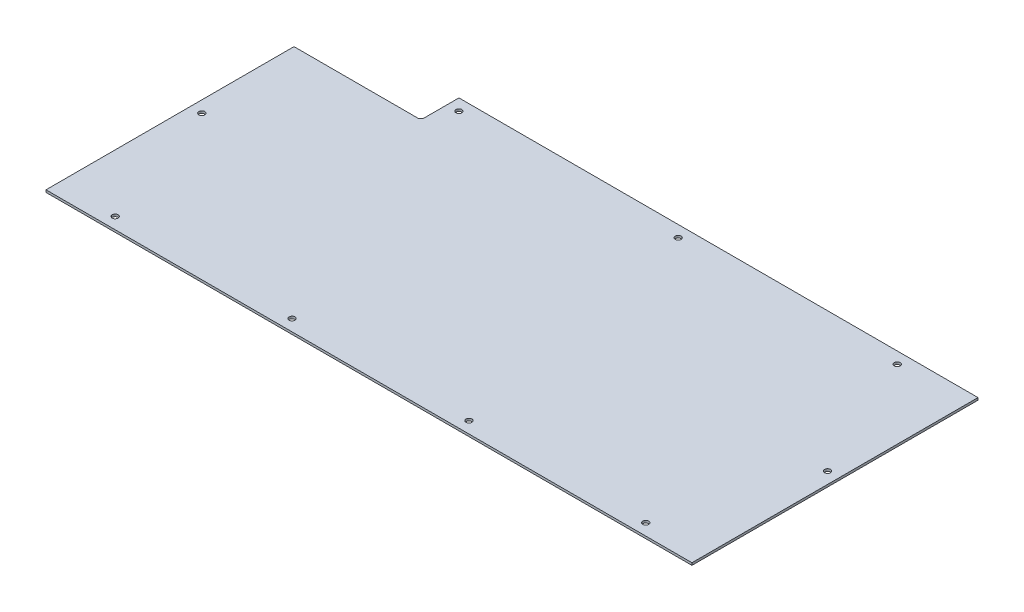
ISO-10303-21;
HEADER;
FILE_DESCRIPTION(('STEP AP214'),'2;1');
FILE_NAME('part.step','',(''),(''),'','','');
FILE_SCHEMA(('AUTOMOTIVE_DESIGN { 1 0 10303 214 1 1 1 1 }'));
ENDSEC;
DATA;
#1=APPLICATION_CONTEXT('core data for automotive mechanical design processes');
#2=APPLICATION_PROTOCOL_DEFINITION('international standard','automotive_design',2000,#1);
#3=PRODUCT_CONTEXT('',#1,'mechanical');
#4=PRODUCT('Part','Part','',(#3));
#5=PRODUCT_RELATED_PRODUCT_CATEGORY('part','',(#4));
#6=PRODUCT_DEFINITION_FORMATION('','',#4);
#7=PRODUCT_DEFINITION_CONTEXT('part definition',#1,'design');
#8=PRODUCT_DEFINITION('design','',#6,#7);
#9=PRODUCT_DEFINITION_SHAPE('','',#8);
#10=(LENGTH_UNIT() NAMED_UNIT(*) SI_UNIT(.MILLI.,.METRE.));
#11=(NAMED_UNIT(*) PLANE_ANGLE_UNIT() SI_UNIT($,.RADIAN.));
#12=(NAMED_UNIT(*) SI_UNIT($,.STERADIAN.) SOLID_ANGLE_UNIT());
#13=UNCERTAINTY_MEASURE_WITH_UNIT(LENGTH_MEASURE(1.E-05),#10,'distance_accuracy_value','');
#14=(GEOMETRIC_REPRESENTATION_CONTEXT(3) GLOBAL_UNCERTAINTY_ASSIGNED_CONTEXT((#13)) GLOBAL_UNIT_ASSIGNED_CONTEXT((#10,
#11,#12)) REPRESENTATION_CONTEXT('',''));
#15=CARTESIAN_POINT('',(0.,0.,0.));
#16=DIRECTION('',(0.,0.,1.));
#17=DIRECTION('',(1.,0.,0.));
#18=AXIS2_PLACEMENT_3D('',#15,#16,#17);
#19=CARTESIAN_POINT('',(-181.14438228891,2.,-90.393202129197));
#20=DIRECTION('',(0.,-1.,0.));
#21=DIRECTION('',(0.,0.,-1.));
#22=AXIS2_PLACEMENT_3D('',#19,#20,#21);
#23=PLANE('',#22);
#24=DIRECTION('',(0.,0.,-1.));
#25=VECTOR('',#24,1.);
#26=CARTESIAN_POINT('',(271.85561771109,2.,127.606797870803));
#27=LINE('',#26,#25);
#28=CARTESIAN_POINT('',(271.85561771109,2.,127.606797870803));
#29=VERTEX_POINT('',#28);
#30=CARTESIAN_POINT('',(271.85561771109,2.,-120.393202129197));
#31=VERTEX_POINT('',#30);
#32=EDGE_CURVE('E137',#29,#31,#27,.T.);
#33=ORIENTED_EDGE('',*,*,#32,.T.);
#34=DIRECTION('',(-1.,0.,0.));
#35=VECTOR('',#34,1.);
#36=CARTESIAN_POINT('',(-178.14438228891,2.,-120.393202129197));
#37=LINE('',#36,#35);
#38=CARTESIAN_POINT('',(-178.14438228891,2.,-120.393202129197));
#39=VERTEX_POINT('',#38);
#40=EDGE_CURVE('E90',#31,#39,#37,.T.);
#41=ORIENTED_EDGE('',*,*,#40,.T.);
#42=DIRECTION('',(0.,0.,1.));
#43=VECTOR('',#42,1.);
#44=CARTESIAN_POINT('',(-178.14438228891,2.,-90.393202129197));
#45=LINE('',#44,#43);
#46=CARTESIAN_POINT('',(-178.14438228891,2.,-90.393202129197));
#47=VERTEX_POINT('',#46);
#48=EDGE_CURVE('E149',#39,#47,#45,.T.);
#49=ORIENTED_EDGE('',*,*,#48,.T.);
#50=CARTESIAN_POINT('',(-181.14438228891,2.,-90.393202129197));
#51=DIRECTION('',(0.,-1.,0.));
#52=DIRECTION('',(0.,0.,-1.));
#53=AXIS2_PLACEMENT_3D('',#50,#51,#52);
#54=CIRCLE('',#53,3.00000000000001);
#55=CARTESIAN_POINT('',(-181.144388941207,2.,-87.3932021292044));
#56=VERTEX_POINT('',#55);
#57=EDGE_CURVE('E106',#47,#56,#54,.T.);
#58=ORIENTED_EDGE('',*,*,#57,.T.);
#59=DIRECTION('',(-0.999999999997541,0.,-2.21743215454546E-06));
#60=VECTOR('',#59,1.);
#61=CARTESIAN_POINT('',(-288.14438228891,2.,-87.3934393944302));
#62=LINE('',#61,#60);
#63=CARTESIAN_POINT('',(-288.14438228891,2.,-87.3934393944302));
#64=VERTEX_POINT('',#63);
#65=EDGE_CURVE('E100',#56,#64,#62,.T.);
#66=ORIENTED_EDGE('',*,*,#65,.T.);
#67=DIRECTION('',(0.,0.,1.));
#68=VECTOR('',#67,1.);
#69=CARTESIAN_POINT('',(-288.14438228891,2.,127.606797870803));
#70=LINE('',#69,#68);
#71=CARTESIAN_POINT('',(-288.14438228891,2.,127.606797870803));
#72=VERTEX_POINT('',#71);
#73=EDGE_CURVE('E104',#64,#72,#70,.T.);
#74=ORIENTED_EDGE('',*,*,#73,.T.);
#75=DIRECTION('',(1.,0.,0.));
#76=VECTOR('',#75,1.);
#77=CARTESIAN_POINT('',(-288.14438228891,2.,127.606797870803));
#78=LINE('',#77,#76);
#79=EDGE_CURVE('E50',#72,#29,#78,.T.);
#80=ORIENTED_EDGE('',*,*,#79,.T.);
#81=EDGE_LOOP('',(#33,#41,#49,#58,#66,#74,#80));
#82=FACE_BOUND('',#81,.T.);
#83=CARTESIAN_POINT('',(211.85561771109,2.,-110.393202129197));
#84=DIRECTION('',(0.,1.,0.));
#85=DIRECTION('',(0.,0.,1.));
#86=AXIS2_PLACEMENT_3D('',#83,#84,#85);
#87=CIRCLE('',#86,2.54999999999999);
#88=CARTESIAN_POINT('',(211.85561771109,2.,-107.843202129197));
#89=VERTEX_POINT('',#88);
#90=EDGE_CURVE('E128',#89,#89,#87,.T.);
#91=ORIENTED_EDGE('',*,*,#90,.F.);
#92=EDGE_LOOP('',(#91));
#93=FACE_BOUND('',#92,.T.);
#94=CARTESIAN_POINT('',(-168.14438228891,2.,-110.393202129197));
#95=DIRECTION('',(0.,1.,0.));
#96=DIRECTION('',(0.,0.,1.));
#97=AXIS2_PLACEMENT_3D('',#94,#95,#96);
#98=CIRCLE('',#97,2.54999999999999);
#99=CARTESIAN_POINT('',(-168.14438228891,2.,-107.843202129197));
#100=VERTEX_POINT('',#99);
#101=EDGE_CURVE('E164',#100,#100,#98,.T.);
#102=ORIENTED_EDGE('',*,*,#101,.F.);
#103=EDGE_LOOP('',(#102));
#104=FACE_BOUND('',#103,.T.);
#105=CARTESIAN_POINT('',(21.85561771109,2.,-110.393202129197));
#106=DIRECTION('',(0.,1.,0.));
#107=DIRECTION('',(0.,0.,1.));
#108=AXIS2_PLACEMENT_3D('',#105,#106,#107);
#109=CIRCLE('',#108,2.54999999999999);
#110=CARTESIAN_POINT('',(21.85561771109,2.,-107.843202129197));
#111=VERTEX_POINT('',#110);
#112=EDGE_CURVE('E170',#111,#111,#109,.T.);
#113=ORIENTED_EDGE('',*,*,#112,.F.);
#114=EDGE_LOOP('',(#113));
#115=FACE_BOUND('',#114,.T.);
#116=CARTESIAN_POINT('',(-238.14438228891,2.,117.606797870803));
#117=DIRECTION('',(0.,1.,0.));
#118=DIRECTION('',(0.,0.,1.));
#119=AXIS2_PLACEMENT_3D('',#116,#117,#118);
#120=CIRCLE('',#119,2.54999999999999);
#121=CARTESIAN_POINT('',(-238.14438228891,2.,120.156797870803));
#122=VERTEX_POINT('',#121);
#123=EDGE_CURVE('E176',#122,#122,#120,.T.);
#124=ORIENTED_EDGE('',*,*,#123,.F.);
#125=EDGE_LOOP('',(#124));
#126=FACE_BOUND('',#125,.T.);
#127=CARTESIAN_POINT('',(261.85561771109,2.,0.));
#128=DIRECTION('',(0.,1.,0.));
#129=DIRECTION('',(0.,0.,1.));
#130=AXIS2_PLACEMENT_3D('',#127,#128,#129);
#131=CIRCLE('',#130,2.54999999999999);
#132=CARTESIAN_POINT('',(261.85561771109,2.,2.54999999999999));
#133=VERTEX_POINT('',#132);
#134=EDGE_CURVE('E182',#133,#133,#131,.T.);
#135=ORIENTED_EDGE('',*,*,#134,.F.);
#136=EDGE_LOOP('',(#135));
#137=FACE_BOUND('',#136,.T.);
#138=CARTESIAN_POINT('',(-84.8110489555766,2.,117.606797870803));
#139=DIRECTION('',(0.,1.,0.));
#140=DIRECTION('',(0.,0.,1.));
#141=AXIS2_PLACEMENT_3D('',#138,#139,#140);
#142=CIRCLE('',#141,2.54999999999999);
#143=CARTESIAN_POINT('',(-84.8110489555766,2.,120.156797870803));
#144=VERTEX_POINT('',#143);
#145=EDGE_CURVE('E188',#144,#144,#142,.T.);
#146=ORIENTED_EDGE('',*,*,#145,.F.);
#147=EDGE_LOOP('',(#146));
#148=FACE_BOUND('',#147,.T.);
#149=CARTESIAN_POINT('',(68.5222843777568,2.,117.606797870803));
#150=DIRECTION('',(0.,1.,0.));
#151=DIRECTION('',(0.,0.,1.));
#152=AXIS2_PLACEMENT_3D('',#149,#150,#151);
#153=CIRCLE('',#152,2.54999999999999);
#154=CARTESIAN_POINT('',(68.5222843777568,2.,120.156797870803));
#155=VERTEX_POINT('',#154);
#156=EDGE_CURVE('E194',#155,#155,#153,.T.);
#157=ORIENTED_EDGE('',*,*,#156,.F.);
#158=EDGE_LOOP('',(#157));
#159=FACE_BOUND('',#158,.T.);
#160=CARTESIAN_POINT('',(221.85561771109,2.,117.606797870803));
#161=DIRECTION('',(0.,1.,0.));
#162=DIRECTION('',(0.,0.,1.));
#163=AXIS2_PLACEMENT_3D('',#160,#161,#162);
#164=CIRCLE('',#163,2.54999999999999);
#165=CARTESIAN_POINT('',(221.85561771109,2.,120.156797870803));
#166=VERTEX_POINT('',#165);
#167=EDGE_CURVE('E200',#166,#166,#164,.T.);
#168=ORIENTED_EDGE('',*,*,#167,.F.);
#169=EDGE_LOOP('',(#168));
#170=FACE_BOUND('',#169,.T.);
#171=CARTESIAN_POINT('',(-278.14438228891,2.,2.54999999999999));
#172=DIRECTION('',(0.,1.,0.));
#173=DIRECTION('',(0.,0.,1.));
#174=AXIS2_PLACEMENT_3D('',#171,#172,#173);
#175=CIRCLE('',#174,2.54999999999999);
#176=CARTESIAN_POINT('',(-278.14438228891,2.,5.09999999999998));
#177=VERTEX_POINT('',#176);
#178=EDGE_CURVE('E206',#177,#177,#175,.T.);
#179=ORIENTED_EDGE('',*,*,#178,.F.);
#180=EDGE_LOOP('',(#179));
#181=FACE_BOUND('',#180,.T.);
#182=ADVANCED_FACE('F33',(#82,#93,#104,#115,#126,#137,#148,#159,#170,#181),#23,.F.);
#183=CARTESIAN_POINT('',(-181.14438228891,0.,-90.393202129197));
#184=DIRECTION('',(0.,-1.,0.));
#185=DIRECTION('',(0.,0.,-1.));
#186=AXIS2_PLACEMENT_3D('',#183,#184,#185);
#187=PLANE('',#186);
#188=CARTESIAN_POINT('',(221.85561771109,0.,117.606797870803));
#189=DIRECTION('',(0.,1.,0.));
#190=DIRECTION('',(0.,0.,1.));
#191=AXIS2_PLACEMENT_3D('',#188,#189,#190);
#192=CIRCLE('',#191,2.54999999999999);
#193=CARTESIAN_POINT('',(221.85561771109,0.,120.156797870803));
#194=VERTEX_POINT('',#193);
#195=EDGE_CURVE('E203',#194,#194,#192,.T.);
#196=ORIENTED_EDGE('',*,*,#195,.T.);
#197=EDGE_LOOP('',(#196));
#198=FACE_BOUND('',#197,.T.);
#199=CARTESIAN_POINT('',(-84.8110489555766,0.,117.606797870803));
#200=DIRECTION('',(0.,1.,0.));
#201=DIRECTION('',(0.,0.,1.));
#202=AXIS2_PLACEMENT_3D('',#199,#200,#201);
#203=CIRCLE('',#202,2.54999999999999);
#204=CARTESIAN_POINT('',(-84.8110489555766,0.,120.156797870803));
#205=VERTEX_POINT('',#204);
#206=EDGE_CURVE('E191',#205,#205,#203,.T.);
#207=ORIENTED_EDGE('',*,*,#206,.T.);
#208=EDGE_LOOP('',(#207));
#209=FACE_BOUND('',#208,.T.);
#210=CARTESIAN_POINT('',(-238.14438228891,0.,117.606797870803));
#211=DIRECTION('',(0.,1.,0.));
#212=DIRECTION('',(0.,0.,1.));
#213=AXIS2_PLACEMENT_3D('',#210,#211,#212);
#214=CIRCLE('',#213,2.54999999999999);
#215=CARTESIAN_POINT('',(-238.14438228891,0.,120.156797870803));
#216=VERTEX_POINT('',#215);
#217=EDGE_CURVE('E179',#216,#216,#214,.T.);
#218=ORIENTED_EDGE('',*,*,#217,.T.);
#219=EDGE_LOOP('',(#218));
#220=FACE_BOUND('',#219,.T.);
#221=CARTESIAN_POINT('',(-168.14438228891,0.,-110.393202129197));
#222=DIRECTION('',(0.,1.,0.));
#223=DIRECTION('',(0.,0.,1.));
#224=AXIS2_PLACEMENT_3D('',#221,#222,#223);
#225=CIRCLE('',#224,2.54999999999999);
#226=CARTESIAN_POINT('',(-168.14438228891,0.,-107.843202129197));
#227=VERTEX_POINT('',#226);
#228=EDGE_CURVE('E167',#227,#227,#225,.T.);
#229=ORIENTED_EDGE('',*,*,#228,.T.);
#230=EDGE_LOOP('',(#229));
#231=FACE_BOUND('',#230,.T.);
#232=DIRECTION('',(0.,0.,-1.));
#233=VECTOR('',#232,1.);
#234=CARTESIAN_POINT('',(271.85561771109,0.,127.606797870803));
#235=LINE('',#234,#233);
#236=CARTESIAN_POINT('',(271.85561771109,0.,127.606797870803));
#237=VERTEX_POINT('',#236);
#238=CARTESIAN_POINT('',(271.85561771109,0.,-120.393202129197));
#239=VERTEX_POINT('',#238);
#240=EDGE_CURVE('E124',#237,#239,#235,.T.);
#241=ORIENTED_EDGE('',*,*,#240,.F.);
#242=DIRECTION('',(1.,0.,0.));
#243=VECTOR('',#242,1.);
#244=CARTESIAN_POINT('',(-288.14438228891,0.,127.606797870803));
#245=LINE('',#244,#243);
#246=CARTESIAN_POINT('',(-288.14438228891,0.,127.606797870803));
#247=VERTEX_POINT('',#246);
#248=EDGE_CURVE('E82',#247,#237,#245,.T.);
#249=ORIENTED_EDGE('',*,*,#248,.F.);
#250=DIRECTION('',(0.,0.,1.));
#251=VECTOR('',#250,1.);
#252=CARTESIAN_POINT('',(-288.14438228891,0.,127.606797870803));
#253=LINE('',#252,#251);
#254=CARTESIAN_POINT('',(-288.14438228891,0.,-87.3934393944302));
#255=VERTEX_POINT('',#254);
#256=EDGE_CURVE('E76',#255,#247,#253,.T.);
#257=ORIENTED_EDGE('',*,*,#256,.F.);
#258=DIRECTION('',(-0.999999999997541,0.,-2.21743215454546E-06));
#259=VECTOR('',#258,1.);
#260=CARTESIAN_POINT('',(-288.14438228891,0.,-87.3934393944302));
#261=LINE('',#260,#259);
#262=CARTESIAN_POINT('',(-181.144388941207,0.,-87.3932021292044));
#263=VERTEX_POINT('',#262);
#264=EDGE_CURVE('E114',#263,#255,#261,.T.);
#265=ORIENTED_EDGE('',*,*,#264,.F.);
#266=CARTESIAN_POINT('',(-181.14438228891,0.,-90.393202129197));
#267=DIRECTION('',(0.,-1.,0.));
#268=DIRECTION('',(0.,0.,-1.));
#269=AXIS2_PLACEMENT_3D('',#266,#267,#268);
#270=CIRCLE('',#269,3.00000000000001);
#271=CARTESIAN_POINT('',(-178.14438228891,0.,-90.393202129197));
#272=VERTEX_POINT('',#271);
#273=EDGE_CURVE('E132',#272,#263,#270,.T.);
#274=ORIENTED_EDGE('',*,*,#273,.F.);
#275=DIRECTION('',(0.,0.,1.));
#276=VECTOR('',#275,1.);
#277=CARTESIAN_POINT('',(-178.14438228891,0.,-90.393202129197));
#278=LINE('',#277,#276);
#279=CARTESIAN_POINT('',(-178.14438228891,0.,-120.393202129197));
#280=VERTEX_POINT('',#279);
#281=EDGE_CURVE('E130',#280,#272,#278,.T.);
#282=ORIENTED_EDGE('',*,*,#281,.F.);
#283=DIRECTION('',(-1.,0.,0.));
#284=VECTOR('',#283,1.);
#285=CARTESIAN_POINT('',(-178.14438228891,0.,-120.393202129197));
#286=LINE('',#285,#284);
#287=EDGE_CURVE('E127',#239,#280,#286,.T.);
#288=ORIENTED_EDGE('',*,*,#287,.F.);
#289=EDGE_LOOP('',(#241,#249,#257,#265,#274,#282,#288));
#290=FACE_BOUND('',#289,.T.);
#291=CARTESIAN_POINT('',(211.85561771109,0.,-110.393202129197));
#292=DIRECTION('',(0.,1.,0.));
#293=DIRECTION('',(0.,0.,1.));
#294=AXIS2_PLACEMENT_3D('',#291,#292,#293);
#295=CIRCLE('',#294,2.54999999999999);
#296=CARTESIAN_POINT('',(211.85561771109,0.,-107.843202129197));
#297=VERTEX_POINT('',#296);
#298=EDGE_CURVE('E161',#297,#297,#295,.T.);
#299=ORIENTED_EDGE('',*,*,#298,.T.);
#300=EDGE_LOOP('',(#299));
#301=FACE_BOUND('',#300,.T.);
#302=CARTESIAN_POINT('',(21.85561771109,0.,-110.393202129197));
#303=DIRECTION('',(0.,1.,0.));
#304=DIRECTION('',(0.,0.,1.));
#305=AXIS2_PLACEMENT_3D('',#302,#303,#304);
#306=CIRCLE('',#305,2.54999999999999);
#307=CARTESIAN_POINT('',(21.85561771109,0.,-107.843202129197));
#308=VERTEX_POINT('',#307);
#309=EDGE_CURVE('E173',#308,#308,#306,.T.);
#310=ORIENTED_EDGE('',*,*,#309,.T.);
#311=EDGE_LOOP('',(#310));
#312=FACE_BOUND('',#311,.T.);
#313=CARTESIAN_POINT('',(261.85561771109,0.,0.));
#314=DIRECTION('',(0.,1.,0.));
#315=DIRECTION('',(0.,0.,1.));
#316=AXIS2_PLACEMENT_3D('',#313,#314,#315);
#317=CIRCLE('',#316,2.54999999999999);
#318=CARTESIAN_POINT('',(261.85561771109,0.,2.54999999999999));
#319=VERTEX_POINT('',#318);
#320=EDGE_CURVE('E185',#319,#319,#317,.T.);
#321=ORIENTED_EDGE('',*,*,#320,.T.);
#322=EDGE_LOOP('',(#321));
#323=FACE_BOUND('',#322,.T.);
#324=CARTESIAN_POINT('',(68.5222843777568,0.,117.606797870803));
#325=DIRECTION('',(0.,1.,0.));
#326=DIRECTION('',(0.,0.,1.));
#327=AXIS2_PLACEMENT_3D('',#324,#325,#326);
#328=CIRCLE('',#327,2.54999999999999);
#329=CARTESIAN_POINT('',(68.5222843777568,0.,120.156797870803));
#330=VERTEX_POINT('',#329);
#331=EDGE_CURVE('E197',#330,#330,#328,.T.);
#332=ORIENTED_EDGE('',*,*,#331,.T.);
#333=EDGE_LOOP('',(#332));
#334=FACE_BOUND('',#333,.T.);
#335=CARTESIAN_POINT('',(-278.14438228891,0.,2.54999999999999));
#336=DIRECTION('',(0.,1.,0.));
#337=DIRECTION('',(0.,0.,1.));
#338=AXIS2_PLACEMENT_3D('',#335,#336,#337);
#339=CIRCLE('',#338,2.54999999999999);
#340=CARTESIAN_POINT('',(-278.14438228891,0.,5.09999999999998));
#341=VERTEX_POINT('',#340);
#342=EDGE_CURVE('E209',#341,#341,#339,.T.);
#343=ORIENTED_EDGE('',*,*,#342,.T.);
#344=EDGE_LOOP('',(#343));
#345=FACE_BOUND('',#344,.T.);
#346=ADVANCED_FACE('F153',(#198,#209,#220,#231,#290,#301,#312,#323,#334,#345),#187,.T.);
#347=CARTESIAN_POINT('',(271.85561771109,2.,127.606797870803));
#348=DIRECTION('',(-1.,0.,0.));
#349=DIRECTION('',(0.,0.,1.));
#350=AXIS2_PLACEMENT_3D('',#347,#348,#349);
#351=PLANE('',#350);
#352=ORIENTED_EDGE('',*,*,#240,.T.);
#353=DIRECTION('',(0.,-1.,0.));
#354=VECTOR('',#353,1.);
#355=CARTESIAN_POINT('',(271.85561771109,2.,-120.393202129197));
#356=LINE('',#355,#354);
#357=EDGE_CURVE('E11',#31,#239,#356,.T.);
#358=ORIENTED_EDGE('',*,*,#357,.F.);
#359=ORIENTED_EDGE('',*,*,#32,.F.);
#360=DIRECTION('',(0.,-1.,0.));
#361=VECTOR('',#360,1.);
#362=CARTESIAN_POINT('',(271.85561771109,2.,127.606797870803));
#363=LINE('',#362,#361);
#364=EDGE_CURVE('E120',#29,#237,#363,.T.);
#365=ORIENTED_EDGE('',*,*,#364,.T.);
#366=EDGE_LOOP('',(#352,#358,#359,#365));
#367=FACE_BOUND('',#366,.T.);
#368=ADVANCED_FACE('F35',(#367),#351,.F.);
#369=CARTESIAN_POINT('',(-178.14438228891,2.,-120.393202129197));
#370=DIRECTION('',(0.,0.,1.));
#371=DIRECTION('',(1.,0.,0.));
#372=AXIS2_PLACEMENT_3D('',#369,#370,#371);
#373=PLANE('',#372);
#374=ORIENTED_EDGE('',*,*,#287,.T.);
#375=DIRECTION('',(0.,-1.,0.));
#376=VECTOR('',#375,1.);
#377=CARTESIAN_POINT('',(-178.14438228891,2.,-120.393202129197));
#378=LINE('',#377,#376);
#379=EDGE_CURVE('E42',#39,#280,#378,.T.);
#380=ORIENTED_EDGE('',*,*,#379,.F.);
#381=ORIENTED_EDGE('',*,*,#40,.F.);
#382=ORIENTED_EDGE('',*,*,#357,.T.);
#383=EDGE_LOOP('',(#374,#380,#381,#382));
#384=FACE_BOUND('',#383,.T.);
#385=ADVANCED_FACE('F239',(#384),#373,.F.);
#386=CARTESIAN_POINT('',(-178.14438228891,2.,-90.393202129197));
#387=DIRECTION('',(1.,0.,0.));
#388=DIRECTION('',(0.,0.,-1.));
#389=AXIS2_PLACEMENT_3D('',#386,#387,#388);
#390=PLANE('',#389);
#391=ORIENTED_EDGE('',*,*,#281,.T.);
#392=DIRECTION('',(0.,-1.,0.));
#393=VECTOR('',#392,1.);
#394=CARTESIAN_POINT('',(-178.14438228891,2.,-90.393202129197));
#395=LINE('',#394,#393);
#396=EDGE_CURVE('E141',#47,#272,#395,.T.);
#397=ORIENTED_EDGE('',*,*,#396,.F.);
#398=ORIENTED_EDGE('',*,*,#48,.F.);
#399=ORIENTED_EDGE('',*,*,#379,.T.);
#400=EDGE_LOOP('',(#391,#397,#398,#399));
#401=FACE_BOUND('',#400,.T.);
#402=ADVANCED_FACE('F147',(#401),#390,.F.);
#403=CARTESIAN_POINT('',(-181.14438228891,2.,-90.393202129197));
#404=DIRECTION('',(0.,-1.,0.));
#405=DIRECTION('',(0.,0.,-1.));
#406=AXIS2_PLACEMENT_3D('',#403,#404,#405);
#407=CYLINDRICAL_SURFACE('',#406,3.00000000000001);
#408=ORIENTED_EDGE('',*,*,#273,.T.);
#409=DIRECTION('',(0.,-1.,0.));
#410=VECTOR('',#409,1.);
#411=CARTESIAN_POINT('',(-181.144388941207,2.,-87.3932021292044));
#412=LINE('',#411,#410);
#413=EDGE_CURVE('E115',#56,#263,#412,.T.);
#414=ORIENTED_EDGE('',*,*,#413,.F.);
#415=ORIENTED_EDGE('',*,*,#57,.F.);
#416=ORIENTED_EDGE('',*,*,#396,.T.);
#417=EDGE_LOOP('',(#408,#414,#415,#416));
#418=FACE_BOUND('',#417,.T.);
#419=ADVANCED_FACE('F156',(#418),#407,.F.);
#420=CARTESIAN_POINT('',(-288.14438228891,2.,-87.3934393944302));
#421=DIRECTION('',(-2.21743215454546E-06,0.,0.999999999997542));
#422=DIRECTION('',(0.999999999997542,0.,2.21743215454546E-06));
#423=AXIS2_PLACEMENT_3D('',#420,#421,#422);
#424=PLANE('',#423);
#425=ORIENTED_EDGE('',*,*,#264,.T.);
#426=DIRECTION('',(0.,-1.,0.));
#427=VECTOR('',#426,1.);
#428=CARTESIAN_POINT('',(-288.14438228891,2.,-87.3934393944302));
#429=LINE('',#428,#427);
#430=EDGE_CURVE('E111',#64,#255,#429,.T.);
#431=ORIENTED_EDGE('',*,*,#430,.F.);
#432=ORIENTED_EDGE('',*,*,#65,.F.);
#433=ORIENTED_EDGE('',*,*,#413,.T.);
#434=EDGE_LOOP('',(#425,#431,#432,#433));
#435=FACE_BOUND('',#434,.T.);
#436=ADVANCED_FACE('F112',(#435),#424,.F.);
#437=CARTESIAN_POINT('',(-288.14438228891,2.,127.606797870803));
#438=DIRECTION('',(1.,0.,0.));
#439=DIRECTION('',(0.,0.,-1.));
#440=AXIS2_PLACEMENT_3D('',#437,#438,#439);
#441=PLANE('',#440);
#442=ORIENTED_EDGE('',*,*,#256,.T.);
#443=DIRECTION('',(0.,-1.,0.));
#444=VECTOR('',#443,1.);
#445=CARTESIAN_POINT('',(-288.14438228891,2.,127.606797870803));
#446=LINE('',#445,#444);
#447=EDGE_CURVE('E116',#72,#247,#446,.T.);
#448=ORIENTED_EDGE('',*,*,#447,.F.);
#449=ORIENTED_EDGE('',*,*,#73,.F.);
#450=ORIENTED_EDGE('',*,*,#430,.T.);
#451=EDGE_LOOP('',(#442,#448,#449,#450));
#452=FACE_BOUND('',#451,.T.);
#453=ADVANCED_FACE('F118',(#452),#441,.F.);
#454=CARTESIAN_POINT('',(-288.14438228891,2.,127.606797870803));
#455=DIRECTION('',(0.,0.,-1.));
#456=DIRECTION('',(-1.,0.,0.));
#457=AXIS2_PLACEMENT_3D('',#454,#455,#456);
#458=PLANE('',#457);
#459=ORIENTED_EDGE('',*,*,#248,.T.);
#460=ORIENTED_EDGE('',*,*,#364,.F.);
#461=ORIENTED_EDGE('',*,*,#79,.F.);
#462=ORIENTED_EDGE('',*,*,#447,.T.);
#463=EDGE_LOOP('',(#459,#460,#461,#462));
#464=FACE_BOUND('',#463,.T.);
#465=ADVANCED_FACE('F229',(#464),#458,.F.);
#466=CARTESIAN_POINT('',(211.85561771109,2.,-110.393202129197));
#467=DIRECTION('',(0.,-1.,0.));
#468=DIRECTION('',(0.,0.,-1.));
#469=AXIS2_PLACEMENT_3D('',#466,#467,#468);
#470=CYLINDRICAL_SURFACE('',#469,2.54999999999999);
#471=ORIENTED_EDGE('',*,*,#90,.T.);
#472=EDGE_LOOP('',(#471));
#473=FACE_BOUND('',#472,.T.);
#474=ORIENTED_EDGE('',*,*,#298,.F.);
#475=EDGE_LOOP('',(#474));
#476=FACE_BOUND('',#475,.T.);
#477=ADVANCED_FACE('F226',(#473,#476),#470,.F.);
#478=CARTESIAN_POINT('',(-168.14438228891,2.,-110.393202129197));
#479=DIRECTION('',(0.,-1.,0.));
#480=DIRECTION('',(0.,0.,-1.));
#481=AXIS2_PLACEMENT_3D('',#478,#479,#480);
#482=CYLINDRICAL_SURFACE('',#481,2.54999999999999);
#483=ORIENTED_EDGE('',*,*,#101,.T.);
#484=EDGE_LOOP('',(#483));
#485=FACE_BOUND('',#484,.T.);
#486=ORIENTED_EDGE('',*,*,#228,.F.);
#487=EDGE_LOOP('',(#486));
#488=FACE_BOUND('',#487,.T.);
#489=ADVANCED_FACE('F298',(#485,#488),#482,.F.);
#490=CARTESIAN_POINT('',(21.85561771109,2.,-110.393202129197));
#491=DIRECTION('',(0.,-1.,0.));
#492=DIRECTION('',(0.,0.,-1.));
#493=AXIS2_PLACEMENT_3D('',#490,#491,#492);
#494=CYLINDRICAL_SURFACE('',#493,2.54999999999999);
#495=ORIENTED_EDGE('',*,*,#112,.T.);
#496=EDGE_LOOP('',(#495));
#497=FACE_BOUND('',#496,.T.);
#498=ORIENTED_EDGE('',*,*,#309,.F.);
#499=EDGE_LOOP('',(#498));
#500=FACE_BOUND('',#499,.T.);
#501=ADVANCED_FACE('F306',(#497,#500),#494,.F.);
#502=CARTESIAN_POINT('',(-238.14438228891,2.,117.606797870803));
#503=DIRECTION('',(0.,-1.,0.));
#504=DIRECTION('',(0.,0.,-1.));
#505=AXIS2_PLACEMENT_3D('',#502,#503,#504);
#506=CYLINDRICAL_SURFACE('',#505,2.54999999999999);
#507=ORIENTED_EDGE('',*,*,#123,.T.);
#508=EDGE_LOOP('',(#507));
#509=FACE_BOUND('',#508,.T.);
#510=ORIENTED_EDGE('',*,*,#217,.F.);
#511=EDGE_LOOP('',(#510));
#512=FACE_BOUND('',#511,.T.);
#513=ADVANCED_FACE('F314',(#509,#512),#506,.F.);
#514=CARTESIAN_POINT('',(261.85561771109,2.,0.));
#515=DIRECTION('',(0.,-1.,0.));
#516=DIRECTION('',(0.,0.,-1.));
#517=AXIS2_PLACEMENT_3D('',#514,#515,#516);
#518=CYLINDRICAL_SURFACE('',#517,2.54999999999999);
#519=ORIENTED_EDGE('',*,*,#134,.T.);
#520=EDGE_LOOP('',(#519));
#521=FACE_BOUND('',#520,.T.);
#522=ORIENTED_EDGE('',*,*,#320,.F.);
#523=EDGE_LOOP('',(#522));
#524=FACE_BOUND('',#523,.T.);
#525=ADVANCED_FACE('F323',(#521,#524),#518,.F.);
#526=CARTESIAN_POINT('',(-84.8110489555766,2.,117.606797870803));
#527=DIRECTION('',(0.,-1.,0.));
#528=DIRECTION('',(0.,0.,-1.));
#529=AXIS2_PLACEMENT_3D('',#526,#527,#528);
#530=CYLINDRICAL_SURFACE('',#529,2.54999999999999);
#531=ORIENTED_EDGE('',*,*,#145,.T.);
#532=EDGE_LOOP('',(#531));
#533=FACE_BOUND('',#532,.T.);
#534=ORIENTED_EDGE('',*,*,#206,.F.);
#535=EDGE_LOOP('',(#534));
#536=FACE_BOUND('',#535,.T.);
#537=ADVANCED_FACE('F332',(#533,#536),#530,.F.);
#538=CARTESIAN_POINT('',(68.5222843777568,2.,117.606797870803));
#539=DIRECTION('',(0.,-1.,0.));
#540=DIRECTION('',(0.,0.,-1.));
#541=AXIS2_PLACEMENT_3D('',#538,#539,#540);
#542=CYLINDRICAL_SURFACE('',#541,2.54999999999999);
#543=ORIENTED_EDGE('',*,*,#156,.T.);
#544=EDGE_LOOP('',(#543));
#545=FACE_BOUND('',#544,.T.);
#546=ORIENTED_EDGE('',*,*,#331,.F.);
#547=EDGE_LOOP('',(#546));
#548=FACE_BOUND('',#547,.T.);
#549=ADVANCED_FACE('F341',(#545,#548),#542,.F.);
#550=CARTESIAN_POINT('',(221.85561771109,2.,117.606797870803));
#551=DIRECTION('',(0.,-1.,0.));
#552=DIRECTION('',(0.,0.,-1.));
#553=AXIS2_PLACEMENT_3D('',#550,#551,#552);
#554=CYLINDRICAL_SURFACE('',#553,2.54999999999999);
#555=ORIENTED_EDGE('',*,*,#167,.T.);
#556=EDGE_LOOP('',(#555));
#557=FACE_BOUND('',#556,.T.);
#558=ORIENTED_EDGE('',*,*,#195,.F.);
#559=EDGE_LOOP('',(#558));
#560=FACE_BOUND('',#559,.T.);
#561=ADVANCED_FACE('F350',(#557,#560),#554,.F.);
#562=CARTESIAN_POINT('',(-278.14438228891,2.,2.54999999999999));
#563=DIRECTION('',(0.,-1.,0.));
#564=DIRECTION('',(0.,0.,-1.));
#565=AXIS2_PLACEMENT_3D('',#562,#563,#564);
#566=CYLINDRICAL_SURFACE('',#565,2.54999999999999);
#567=ORIENTED_EDGE('',*,*,#178,.T.);
#568=EDGE_LOOP('',(#567));
#569=FACE_BOUND('',#568,.T.);
#570=ORIENTED_EDGE('',*,*,#342,.F.);
#571=EDGE_LOOP('',(#570));
#572=FACE_BOUND('',#571,.T.);
#573=ADVANCED_FACE('F215',(#569,#572),#566,.F.);
#574=CLOSED_SHELL('',(#182,#346,#368,#385,#402,#419,#436,#453,#465,#477,#489,#501,#513,#525,
#537,#549,#561,#573));
#575=MANIFOLD_SOLID_BREP('B2',#574);
#576=ADVANCED_BREP_SHAPE_REPRESENTATION('',(#18,#575),#14);
#577=SHAPE_DEFINITION_REPRESENTATION(#9,#576);
ENDSEC;
END-ISO-10303-21;
